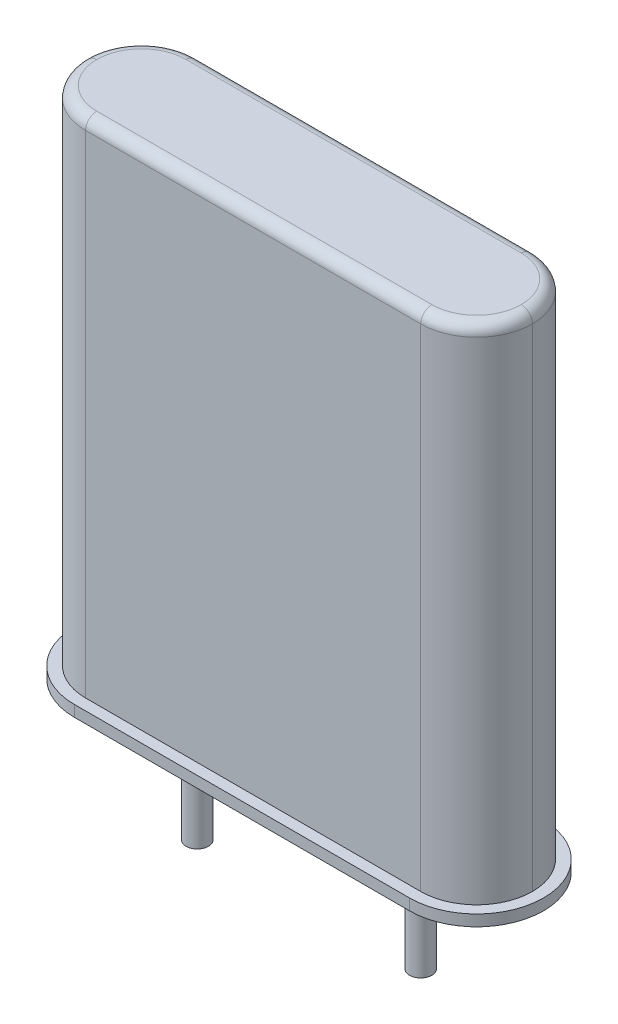
ISO-10303-21;
HEADER;
FILE_DESCRIPTION(('STEP AP214'),'2;1');
FILE_NAME('part.step','',(''),(''),'','','');
FILE_SCHEMA(('AUTOMOTIVE_DESIGN { 1 0 10303 214 1 1 1 1 }'));
ENDSEC;
DATA;
#1=APPLICATION_CONTEXT('core data for automotive mechanical design processes');
#2=APPLICATION_PROTOCOL_DEFINITION('international standard','automotive_design',2000,#1);
#3=PRODUCT_CONTEXT('',#1,'mechanical');
#4=PRODUCT('Part','Part','',(#3));
#5=PRODUCT_RELATED_PRODUCT_CATEGORY('part','',(#4));
#6=PRODUCT_DEFINITION_FORMATION('','',#4);
#7=PRODUCT_DEFINITION_CONTEXT('part definition',#1,'design');
#8=PRODUCT_DEFINITION('design','',#6,#7);
#9=PRODUCT_DEFINITION_SHAPE('','',#8);
#10=(LENGTH_UNIT() NAMED_UNIT(*) SI_UNIT(.MILLI.,.METRE.));
#11=(NAMED_UNIT(*) PLANE_ANGLE_UNIT() SI_UNIT($,.RADIAN.));
#12=(NAMED_UNIT(*) SI_UNIT($,.STERADIAN.) SOLID_ANGLE_UNIT());
#13=UNCERTAINTY_MEASURE_WITH_UNIT(LENGTH_MEASURE(1.E-05),#10,'distance_accuracy_value','');
#14=(GEOMETRIC_REPRESENTATION_CONTEXT(3) GLOBAL_UNCERTAINTY_ASSIGNED_CONTEXT((#13)) GLOBAL_UNIT_ASSIGNED_CONTEXT((#10,
#11,#12)) REPRESENTATION_CONTEXT('',''));
#15=CARTESIAN_POINT('',(0.,0.,0.));
#16=DIRECTION('',(0.,0.,1.));
#17=DIRECTION('',(1.,0.,0.));
#18=AXIS2_PLACEMENT_3D('',#15,#16,#17);
#19=CARTESIAN_POINT('',(-2.54,11.684,1.27));
#20=DIRECTION('',(0.,0.,-1.));
#21=DIRECTION('',(-1.,0.,0.));
#22=AXIS2_PLACEMENT_3D('',#19,#20,#21);
#23=PLANE('',#22);
#24=DIRECTION('',(-1.,0.,0.));
#25=VECTOR('',#24,1.);
#26=CARTESIAN_POINT('',(-2.54,0.254000000000001,1.27));
#27=LINE('',#26,#25);
#28=CARTESIAN_POINT('',(6.35,0.254000000000001,1.27));
#29=VERTEX_POINT('',#28);
#30=CARTESIAN_POINT('',(-1.27,0.254000000000001,1.27));
#31=VERTEX_POINT('',#30);
#32=EDGE_CURVE('E176',#29,#31,#27,.T.);
#33=ORIENTED_EDGE('',*,*,#32,.F.);
#34=DIRECTION('',(0.,1.,0.));
#35=VECTOR('',#34,1.);
#36=CARTESIAN_POINT('',(6.35,11.684,1.27));
#37=LINE('',#36,#35);
#38=CARTESIAN_POINT('',(6.35,11.43,1.27));
#39=VERTEX_POINT('',#38);
#40=EDGE_CURVE('E192',#29,#39,#37,.T.);
#41=ORIENTED_EDGE('',*,*,#40,.T.);
#42=DIRECTION('',(-1.,0.,0.));
#43=VECTOR('',#42,1.);
#44=CARTESIAN_POINT('',(-2.54,11.43,1.27));
#45=LINE('',#44,#43);
#46=CARTESIAN_POINT('',(-1.27,11.43,1.27));
#47=VERTEX_POINT('',#46);
#48=EDGE_CURVE('E228',#39,#47,#45,.T.);
#49=ORIENTED_EDGE('',*,*,#48,.T.);
#50=DIRECTION('',(0.,-1.,0.));
#51=VECTOR('',#50,1.);
#52=CARTESIAN_POINT('',(-1.27,11.684,1.27));
#53=LINE('',#52,#51);
#54=EDGE_CURVE('E194',#47,#31,#53,.T.);
#55=ORIENTED_EDGE('',*,*,#54,.T.);
#56=EDGE_LOOP('',(#33,#41,#49,#55));
#57=FACE_BOUND('',#56,.T.);
#58=ADVANCED_FACE('F31',(#57),#23,.F.);
#59=CARTESIAN_POINT('',(-2.54,11.684,-1.27));
#60=DIRECTION('',(0.,0.,-1.));
#61=DIRECTION('',(-1.,0.,0.));
#62=AXIS2_PLACEMENT_3D('',#59,#60,#61);
#63=PLANE('',#62);
#64=DIRECTION('',(0.,1.,0.));
#65=VECTOR('',#64,1.);
#66=CARTESIAN_POINT('',(6.35,0.,-1.27));
#67=LINE('',#66,#65);
#68=CARTESIAN_POINT('',(6.35,11.43,-1.27));
#69=VERTEX_POINT('',#68);
#70=CARTESIAN_POINT('',(6.35,0.254,-1.27));
#71=VERTEX_POINT('',#70);
#72=EDGE_CURVE('E197',#69,#71,#67,.F.);
#73=ORIENTED_EDGE('',*,*,#72,.T.);
#74=DIRECTION('',(-1.,0.,0.));
#75=VECTOR('',#74,1.);
#76=CARTESIAN_POINT('',(-2.54,0.254000000000001,-1.27));
#77=LINE('',#76,#75);
#78=CARTESIAN_POINT('',(-1.27,0.254000000000001,-1.27));
#79=VERTEX_POINT('',#78);
#80=EDGE_CURVE('E173',#71,#79,#77,.T.);
#81=ORIENTED_EDGE('',*,*,#80,.T.);
#82=DIRECTION('',(0.,-1.,0.));
#83=VECTOR('',#82,1.);
#84=CARTESIAN_POINT('',(-1.27,11.684,-1.27));
#85=LINE('',#84,#83);
#86=CARTESIAN_POINT('',(-1.27,11.43,-1.27));
#87=VERTEX_POINT('',#86);
#88=EDGE_CURVE('E200',#79,#87,#85,.F.);
#89=ORIENTED_EDGE('',*,*,#88,.T.);
#90=DIRECTION('',(-1.,0.,0.));
#91=VECTOR('',#90,1.);
#92=CARTESIAN_POINT('',(6.35,11.43,-1.27));
#93=LINE('',#92,#91);
#94=EDGE_CURVE('E219',#87,#69,#93,.F.);
#95=ORIENTED_EDGE('',*,*,#94,.T.);
#96=EDGE_LOOP('',(#73,#81,#89,#95));
#97=FACE_BOUND('',#96,.T.);
#98=ADVANCED_FACE('F267',(#97),#63,.T.);
#99=CARTESIAN_POINT('',(-1.27,0.,0.));
#100=DIRECTION('',(0.,1.,0.));
#101=DIRECTION('',(0.,0.,1.));
#102=AXIS2_PLACEMENT_3D('',#99,#100,#101);
#103=CYLINDRICAL_SURFACE('',#102,1.27);
#104=ORIENTED_EDGE('',*,*,#88,.F.);
#105=CARTESIAN_POINT('',(-1.27,0.254,0.));
#106=DIRECTION('',(0.,-1.,0.));
#107=DIRECTION('',(0.,0.,-1.));
#108=AXIS2_PLACEMENT_3D('',#105,#106,#107);
#109=CIRCLE('',#108,1.27);
#110=CARTESIAN_POINT('',(-2.54,0.254000000000001,0.));
#111=VERTEX_POINT('',#110);
#112=EDGE_CURVE('E181',#79,#111,#109,.F.);
#113=ORIENTED_EDGE('',*,*,#112,.T.);
#114=DIRECTION('',(0.,-1.,0.));
#115=VECTOR('',#114,1.);
#116=CARTESIAN_POINT('',(-2.54,0.,0.));
#117=LINE('',#116,#115);
#118=CARTESIAN_POINT('',(-2.54,11.43,0.));
#119=VERTEX_POINT('',#118);
#120=EDGE_CURVE('E189',#119,#111,#117,.T.);
#121=ORIENTED_EDGE('',*,*,#120,.F.);
#122=CARTESIAN_POINT('',(-1.27,11.43,0.));
#123=DIRECTION('',(0.,-1.,0.));
#124=DIRECTION('',(0.,0.,-1.));
#125=AXIS2_PLACEMENT_3D('',#122,#123,#124);
#126=CIRCLE('',#125,1.27);
#127=EDGE_CURVE('E40',#119,#87,#126,.T.);
#128=ORIENTED_EDGE('',*,*,#127,.T.);
#129=EDGE_LOOP('',(#104,#113,#121,#128));
#130=FACE_BOUND('',#129,.T.);
#131=ADVANCED_FACE('F262',(#130),#103,.T.);
#132=CARTESIAN_POINT('',(-1.27,11.684,0.));
#133=DIRECTION('',(0.,-1.,0.));
#134=DIRECTION('',(0.,0.,-1.));
#135=AXIS2_PLACEMENT_3D('',#132,#133,#134);
#136=CYLINDRICAL_SURFACE('',#135,1.27);
#137=ORIENTED_EDGE('',*,*,#120,.T.);
#138=CARTESIAN_POINT('',(-1.27,0.254000000000001,0.));
#139=DIRECTION('',(0.,-1.,0.));
#140=DIRECTION('',(0.,0.,-1.));
#141=AXIS2_PLACEMENT_3D('',#138,#139,#140);
#142=CIRCLE('',#141,1.27);
#143=EDGE_CURVE('E178',#111,#31,#142,.F.);
#144=ORIENTED_EDGE('',*,*,#143,.T.);
#145=ORIENTED_EDGE('',*,*,#54,.F.);
#146=CARTESIAN_POINT('',(-1.27,11.43,0.));
#147=DIRECTION('',(0.,-1.,0.));
#148=DIRECTION('',(0.,0.,-1.));
#149=AXIS2_PLACEMENT_3D('',#146,#147,#148);
#150=CIRCLE('',#149,1.27);
#151=EDGE_CURVE('E54',#47,#119,#150,.T.);
#152=ORIENTED_EDGE('',*,*,#151,.T.);
#153=EDGE_LOOP('',(#137,#144,#145,#152));
#154=FACE_BOUND('',#153,.T.);
#155=ADVANCED_FACE('F259',(#154),#136,.T.);
#156=CARTESIAN_POINT('',(6.35,0.,0.));
#157=DIRECTION('',(0.,-1.,0.));
#158=DIRECTION('',(0.,0.,-1.));
#159=AXIS2_PLACEMENT_3D('',#156,#157,#158);
#160=CYLINDRICAL_SURFACE('',#159,1.27);
#161=DIRECTION('',(0.,1.,0.));
#162=VECTOR('',#161,1.);
#163=CARTESIAN_POINT('',(7.62,11.684,0.));
#164=LINE('',#163,#162);
#165=CARTESIAN_POINT('',(7.62,0.254000000000001,0.));
#166=VERTEX_POINT('',#165);
#167=CARTESIAN_POINT('',(7.62,11.43,0.));
#168=VERTEX_POINT('',#167);
#169=EDGE_CURVE('E204',#166,#168,#164,.T.);
#170=ORIENTED_EDGE('',*,*,#169,.F.);
#171=CARTESIAN_POINT('',(6.35,0.254,0.));
#172=DIRECTION('',(0.,-1.,0.));
#173=DIRECTION('',(0.,0.,-1.));
#174=AXIS2_PLACEMENT_3D('',#171,#172,#173);
#175=CIRCLE('',#174,1.27);
#176=EDGE_CURVE('E47',#166,#71,#175,.F.);
#177=ORIENTED_EDGE('',*,*,#176,.T.);
#178=ORIENTED_EDGE('',*,*,#72,.F.);
#179=CARTESIAN_POINT('',(6.35,11.43,0.));
#180=DIRECTION('',(0.,-1.,0.));
#181=DIRECTION('',(0.,0.,-1.));
#182=AXIS2_PLACEMENT_3D('',#179,#180,#181);
#183=CIRCLE('',#182,1.27);
#184=EDGE_CURVE('E222',#69,#168,#183,.T.);
#185=ORIENTED_EDGE('',*,*,#184,.T.);
#186=EDGE_LOOP('',(#170,#177,#178,#185));
#187=FACE_BOUND('',#186,.T.);
#188=ADVANCED_FACE('F271',(#187),#160,.T.);
#189=CARTESIAN_POINT('',(6.35,11.684,0.));
#190=DIRECTION('',(0.,1.,0.));
#191=DIRECTION('',(0.,0.,1.));
#192=AXIS2_PLACEMENT_3D('',#189,#190,#191);
#193=CYLINDRICAL_SURFACE('',#192,1.27);
#194=ORIENTED_EDGE('',*,*,#40,.F.);
#195=CARTESIAN_POINT('',(6.35,0.254000000000001,0.));
#196=DIRECTION('',(0.,-1.,0.));
#197=DIRECTION('',(0.,0.,-1.));
#198=AXIS2_PLACEMENT_3D('',#195,#196,#197);
#199=CIRCLE('',#198,1.27);
#200=EDGE_CURVE('E11',#29,#166,#199,.F.);
#201=ORIENTED_EDGE('',*,*,#200,.T.);
#202=ORIENTED_EDGE('',*,*,#169,.T.);
#203=CARTESIAN_POINT('',(6.35,11.43,0.));
#204=DIRECTION('',(0.,-1.,0.));
#205=DIRECTION('',(0.,0.,-1.));
#206=AXIS2_PLACEMENT_3D('',#203,#204,#205);
#207=CIRCLE('',#206,1.27);
#208=EDGE_CURVE('E225',#168,#39,#207,.T.);
#209=ORIENTED_EDGE('',*,*,#208,.T.);
#210=EDGE_LOOP('',(#194,#201,#202,#209));
#211=FACE_BOUND('',#210,.T.);
#212=ADVANCED_FACE('F274',(#211),#193,.T.);
#213=CARTESIAN_POINT('',(-2.54,11.684,1.27));
#214=DIRECTION('',(0.,-1.,0.));
#215=DIRECTION('',(0.,0.,-1.));
#216=AXIS2_PLACEMENT_3D('',#213,#214,#215);
#217=PLANE('',#216);
#218=CARTESIAN_POINT('',(6.35,11.684,0.));
#219=DIRECTION('',(0.,-1.,0.));
#220=DIRECTION('',(0.,0.,-1.));
#221=AXIS2_PLACEMENT_3D('',#218,#219,#220);
#222=CIRCLE('',#221,1.016);
#223=CARTESIAN_POINT('',(7.366,11.684,0.));
#224=VERTEX_POINT('',#223);
#225=CARTESIAN_POINT('',(6.35,11.684,-1.016));
#226=VERTEX_POINT('',#225);
#227=EDGE_CURVE('E214',#224,#226,#222,.F.);
#228=ORIENTED_EDGE('',*,*,#227,.T.);
#229=DIRECTION('',(-1.,0.,0.));
#230=VECTOR('',#229,1.);
#231=CARTESIAN_POINT('',(-1.27,11.684,-1.016));
#232=LINE('',#231,#230);
#233=CARTESIAN_POINT('',(-1.27,11.684,-1.016));
#234=VERTEX_POINT('',#233);
#235=EDGE_CURVE('E216',#226,#234,#232,.T.);
#236=ORIENTED_EDGE('',*,*,#235,.T.);
#237=CARTESIAN_POINT('',(-1.27,11.684,0.));
#238=DIRECTION('',(0.,-1.,0.));
#239=DIRECTION('',(0.,0.,-1.));
#240=AXIS2_PLACEMENT_3D('',#237,#238,#239);
#241=CIRCLE('',#240,1.016);
#242=CARTESIAN_POINT('',(-2.286,11.684,0.));
#243=VERTEX_POINT('',#242);
#244=EDGE_CURVE('E202',#234,#243,#241,.F.);
#245=ORIENTED_EDGE('',*,*,#244,.T.);
#246=CARTESIAN_POINT('',(-1.27,11.684,0.));
#247=DIRECTION('',(0.,-1.,0.));
#248=DIRECTION('',(0.,0.,-1.));
#249=AXIS2_PLACEMENT_3D('',#246,#247,#248);
#250=CIRCLE('',#249,1.016);
#251=CARTESIAN_POINT('',(-1.27,11.684,1.016));
#252=VERTEX_POINT('',#251);
#253=EDGE_CURVE('E208',#243,#252,#250,.F.);
#254=ORIENTED_EDGE('',*,*,#253,.T.);
#255=DIRECTION('',(-1.,0.,0.));
#256=VECTOR('',#255,1.);
#257=CARTESIAN_POINT('',(-2.54,11.684,1.016));
#258=LINE('',#257,#256);
#259=CARTESIAN_POINT('',(6.35,11.684,1.016));
#260=VERTEX_POINT('',#259);
#261=EDGE_CURVE('E210',#252,#260,#258,.F.);
#262=ORIENTED_EDGE('',*,*,#261,.T.);
#263=CARTESIAN_POINT('',(6.35,11.684,0.));
#264=DIRECTION('',(0.,-1.,0.));
#265=DIRECTION('',(0.,0.,-1.));
#266=AXIS2_PLACEMENT_3D('',#263,#264,#265);
#267=CIRCLE('',#266,1.016);
#268=EDGE_CURVE('E212',#260,#224,#267,.F.);
#269=ORIENTED_EDGE('',*,*,#268,.T.);
#270=EDGE_LOOP('',(#228,#236,#245,#254,#262,#269));
#271=FACE_BOUND('',#270,.T.);
#272=ADVANCED_FACE('F276',(#271),#217,.F.);
#273=CARTESIAN_POINT('',(-2.54,11.43,1.016));
#274=DIRECTION('',(-1.,0.,0.));
#275=DIRECTION('',(0.,0.,1.));
#276=AXIS2_PLACEMENT_3D('',#273,#274,#275);
#277=CYLINDRICAL_SURFACE('',#276,0.254);
#278=CARTESIAN_POINT('',(-1.27,11.43,1.016));
#279=DIRECTION('',(-1.,0.,0.));
#280=DIRECTION('',(0.,0.,1.));
#281=AXIS2_PLACEMENT_3D('',#278,#279,#280);
#282=CIRCLE('',#281,0.254);
#283=EDGE_CURVE('E242',#47,#252,#282,.T.);
#284=ORIENTED_EDGE('',*,*,#283,.F.);
#285=ORIENTED_EDGE('',*,*,#48,.F.);
#286=CARTESIAN_POINT('',(6.35,11.43,1.016));
#287=DIRECTION('',(1.,0.,0.));
#288=DIRECTION('',(0.,0.,-1.));
#289=AXIS2_PLACEMENT_3D('',#286,#287,#288);
#290=CIRCLE('',#289,0.254);
#291=EDGE_CURVE('E206',#260,#39,#290,.T.);
#292=ORIENTED_EDGE('',*,*,#291,.F.);
#293=ORIENTED_EDGE('',*,*,#261,.F.);
#294=EDGE_LOOP('',(#284,#285,#292,#293));
#295=FACE_BOUND('',#294,.T.);
#296=ADVANCED_FACE('F33',(#295),#277,.T.);
#297=CARTESIAN_POINT('',(6.35,11.43,0.));
#298=DIRECTION('',(0.,-1.,0.));
#299=DIRECTION('',(0.,0.,-1.));
#300=AXIS2_PLACEMENT_3D('',#297,#298,#299);
#301=TOROIDAL_SURFACE('',#300,1.016,0.254);
#302=ORIENTED_EDGE('',*,*,#291,.T.);
#303=ORIENTED_EDGE('',*,*,#208,.F.);
#304=CARTESIAN_POINT('',(7.366,11.43,0.));
#305=DIRECTION('',(0.,0.,-1.));
#306=DIRECTION('',(-1.,0.,0.));
#307=AXIS2_PLACEMENT_3D('',#304,#305,#306);
#308=CIRCLE('',#307,0.254);
#309=EDGE_CURVE('E239',#224,#168,#308,.T.);
#310=ORIENTED_EDGE('',*,*,#309,.F.);
#311=ORIENTED_EDGE('',*,*,#268,.F.);
#312=EDGE_LOOP('',(#302,#303,#310,#311));
#313=FACE_BOUND('',#312,.T.);
#314=ADVANCED_FACE('F250',(#313),#301,.T.);
#315=CARTESIAN_POINT('',(-1.27,11.43,0.));
#316=DIRECTION('',(0.,-1.,0.));
#317=DIRECTION('',(0.,0.,-1.));
#318=AXIS2_PLACEMENT_3D('',#315,#316,#317);
#319=TOROIDAL_SURFACE('',#318,1.016,0.254);
#320=ORIENTED_EDGE('',*,*,#283,.T.);
#321=ORIENTED_EDGE('',*,*,#253,.F.);
#322=CARTESIAN_POINT('',(-2.286,11.43,0.));
#323=DIRECTION('',(0.,0.,-1.));
#324=DIRECTION('',(-1.,0.,0.));
#325=AXIS2_PLACEMENT_3D('',#322,#323,#324);
#326=CIRCLE('',#325,0.254);
#327=EDGE_CURVE('E236',#119,#243,#326,.T.);
#328=ORIENTED_EDGE('',*,*,#327,.F.);
#329=ORIENTED_EDGE('',*,*,#151,.F.);
#330=EDGE_LOOP('',(#320,#321,#328,#329));
#331=FACE_BOUND('',#330,.T.);
#332=ADVANCED_FACE('F445',(#331),#319,.T.);
#333=CARTESIAN_POINT('',(6.35,11.43,0.));
#334=DIRECTION('',(0.,-1.,0.));
#335=DIRECTION('',(0.,0.,-1.));
#336=AXIS2_PLACEMENT_3D('',#333,#334,#335);
#337=TOROIDAL_SURFACE('',#336,1.016,0.254);
#338=ORIENTED_EDGE('',*,*,#309,.T.);
#339=ORIENTED_EDGE('',*,*,#184,.F.);
#340=CARTESIAN_POINT('',(6.35,11.43,-1.016));
#341=DIRECTION('',(-1.,0.,0.));
#342=DIRECTION('',(0.,0.,1.));
#343=AXIS2_PLACEMENT_3D('',#340,#341,#342);
#344=CIRCLE('',#343,0.254);
#345=EDGE_CURVE('E234',#226,#69,#344,.T.);
#346=ORIENTED_EDGE('',*,*,#345,.F.);
#347=ORIENTED_EDGE('',*,*,#227,.F.);
#348=EDGE_LOOP('',(#338,#339,#346,#347));
#349=FACE_BOUND('',#348,.T.);
#350=ADVANCED_FACE('F452',(#349),#337,.T.);
#351=CARTESIAN_POINT('',(-1.27,11.43,0.));
#352=DIRECTION('',(0.,-1.,0.));
#353=DIRECTION('',(0.,0.,-1.));
#354=AXIS2_PLACEMENT_3D('',#351,#352,#353);
#355=TOROIDAL_SURFACE('',#354,1.016,0.254);
#356=ORIENTED_EDGE('',*,*,#327,.T.);
#357=ORIENTED_EDGE('',*,*,#244,.F.);
#358=CARTESIAN_POINT('',(-1.27,11.43,-1.016));
#359=DIRECTION('',(1.,0.,0.));
#360=DIRECTION('',(0.,0.,-1.));
#361=AXIS2_PLACEMENT_3D('',#358,#359,#360);
#362=CIRCLE('',#361,0.254);
#363=EDGE_CURVE('E184',#87,#234,#362,.T.);
#364=ORIENTED_EDGE('',*,*,#363,.F.);
#365=ORIENTED_EDGE('',*,*,#127,.F.);
#366=EDGE_LOOP('',(#356,#357,#364,#365));
#367=FACE_BOUND('',#366,.T.);
#368=ADVANCED_FACE('F461',(#367),#355,.T.);
#369=CARTESIAN_POINT('',(-2.54,11.43,-1.016));
#370=DIRECTION('',(1.,0.,0.));
#371=DIRECTION('',(0.,0.,-1.));
#372=AXIS2_PLACEMENT_3D('',#369,#370,#371);
#373=CYLINDRICAL_SURFACE('',#372,0.254);
#374=ORIENTED_EDGE('',*,*,#345,.T.);
#375=ORIENTED_EDGE('',*,*,#94,.F.);
#376=ORIENTED_EDGE('',*,*,#363,.T.);
#377=ORIENTED_EDGE('',*,*,#235,.F.);
#378=EDGE_LOOP('',(#374,#375,#376,#377));
#379=FACE_BOUND('',#378,.T.);
#380=ADVANCED_FACE('F337',(#379),#373,.T.);
#381=CARTESIAN_POINT('',(6.35,0.254,0.));
#382=DIRECTION('',(0.,-1.,0.));
#383=DIRECTION('',(0.,0.,-1.));
#384=AXIS2_PLACEMENT_3D('',#381,#382,#383);
#385=CYLINDRICAL_SURFACE('',#384,1.524);
#386=CARTESIAN_POINT('',(6.35,0.,0.));
#387=DIRECTION('',(0.,-1.,0.));
#388=DIRECTION('',(0.,0.,-1.));
#389=AXIS2_PLACEMENT_3D('',#386,#387,#388);
#390=CIRCLE('',#389,1.524);
#391=CARTESIAN_POINT('',(6.35,0.,-1.524));
#392=VERTEX_POINT('',#391);
#393=CARTESIAN_POINT('',(6.35,0.,1.524));
#394=VERTEX_POINT('',#393);
#395=EDGE_CURVE('E153',#392,#394,#390,.T.);
#396=ORIENTED_EDGE('',*,*,#395,.F.);
#397=DIRECTION('',(0.,-1.,0.));
#398=VECTOR('',#397,1.);
#399=CARTESIAN_POINT('',(6.35,0.254,-1.524));
#400=LINE('',#399,#398);
#401=CARTESIAN_POINT('',(6.35,0.254,-1.524));
#402=VERTEX_POINT('',#401);
#403=EDGE_CURVE('E151',#402,#392,#400,.T.);
#404=ORIENTED_EDGE('',*,*,#403,.F.);
#405=CARTESIAN_POINT('',(6.35,0.254,0.));
#406=DIRECTION('',(0.,-1.,0.));
#407=DIRECTION('',(0.,0.,-1.));
#408=AXIS2_PLACEMENT_3D('',#405,#406,#407);
#409=CIRCLE('',#408,1.524);
#410=CARTESIAN_POINT('',(6.35,0.254,1.524));
#411=VERTEX_POINT('',#410);
#412=EDGE_CURVE('E146',#402,#411,#409,.T.);
#413=ORIENTED_EDGE('',*,*,#412,.T.);
#414=DIRECTION('',(0.,-1.,0.));
#415=VECTOR('',#414,1.);
#416=CARTESIAN_POINT('',(6.35,0.254,1.524));
#417=LINE('',#416,#415);
#418=EDGE_CURVE('E129',#411,#394,#417,.T.);
#419=ORIENTED_EDGE('',*,*,#418,.T.);
#420=EDGE_LOOP('',(#396,#404,#413,#419));
#421=FACE_BOUND('',#420,.T.);
#422=ADVANCED_FACE('F150',(#421),#385,.T.);
#423=CARTESIAN_POINT('',(-1.27,0.254,-1.524));
#424=DIRECTION('',(0.,0.,-1.));
#425=DIRECTION('',(-1.,0.,0.));
#426=AXIS2_PLACEMENT_3D('',#423,#424,#425);
#427=PLANE('',#426);
#428=DIRECTION('',(1.,0.,0.));
#429=VECTOR('',#428,1.);
#430=CARTESIAN_POINT('',(-1.27,0.,-1.524));
#431=LINE('',#430,#429);
#432=CARTESIAN_POINT('',(-1.27,0.,-1.524));
#433=VERTEX_POINT('',#432);
#434=EDGE_CURVE('E155',#433,#392,#431,.T.);
#435=ORIENTED_EDGE('',*,*,#434,.F.);
#436=DIRECTION('',(0.,-1.,0.));
#437=VECTOR('',#436,1.);
#438=CARTESIAN_POINT('',(-1.27,0.254,-1.524));
#439=LINE('',#438,#437);
#440=CARTESIAN_POINT('',(-1.27,0.254,-1.524));
#441=VERTEX_POINT('',#440);
#442=EDGE_CURVE('E169',#441,#433,#439,.T.);
#443=ORIENTED_EDGE('',*,*,#442,.F.);
#444=DIRECTION('',(1.,0.,0.));
#445=VECTOR('',#444,1.);
#446=CARTESIAN_POINT('',(-1.27,0.254,-1.524));
#447=LINE('',#446,#445);
#448=EDGE_CURVE('E140',#441,#402,#447,.T.);
#449=ORIENTED_EDGE('',*,*,#448,.T.);
#450=ORIENTED_EDGE('',*,*,#403,.T.);
#451=EDGE_LOOP('',(#435,#443,#449,#450));
#452=FACE_BOUND('',#451,.T.);
#453=ADVANCED_FACE('F336',(#452),#427,.T.);
#454=CARTESIAN_POINT('',(-1.27,0.254,0.));
#455=DIRECTION('',(0.,-1.,0.));
#456=DIRECTION('',(0.,0.,-1.));
#457=AXIS2_PLACEMENT_3D('',#454,#455,#456);
#458=CYLINDRICAL_SURFACE('',#457,1.524);
#459=CARTESIAN_POINT('',(-1.27,0.,0.));
#460=DIRECTION('',(0.,-1.,0.));
#461=DIRECTION('',(0.,0.,-1.));
#462=AXIS2_PLACEMENT_3D('',#459,#460,#461);
#463=CIRCLE('',#462,1.524);
#464=CARTESIAN_POINT('',(-1.27,0.,1.524));
#465=VERTEX_POINT('',#464);
#466=EDGE_CURVE('E163',#465,#433,#463,.T.);
#467=ORIENTED_EDGE('',*,*,#466,.F.);
#468=DIRECTION('',(0.,-1.,0.));
#469=VECTOR('',#468,1.);
#470=CARTESIAN_POINT('',(-1.27,0.254,1.524));
#471=LINE('',#470,#469);
#472=CARTESIAN_POINT('',(-1.27,0.254,1.524));
#473=VERTEX_POINT('',#472);
#474=EDGE_CURVE('E139',#473,#465,#471,.T.);
#475=ORIENTED_EDGE('',*,*,#474,.F.);
#476=CARTESIAN_POINT('',(-1.27,0.254,0.));
#477=DIRECTION('',(0.,-1.,0.));
#478=DIRECTION('',(0.,0.,-1.));
#479=AXIS2_PLACEMENT_3D('',#476,#477,#478);
#480=CIRCLE('',#479,1.524);
#481=EDGE_CURVE('E148',#473,#441,#480,.T.);
#482=ORIENTED_EDGE('',*,*,#481,.T.);
#483=ORIENTED_EDGE('',*,*,#442,.T.);
#484=EDGE_LOOP('',(#467,#475,#482,#483));
#485=FACE_BOUND('',#484,.T.);
#486=ADVANCED_FACE('F348',(#485),#458,.T.);
#487=CARTESIAN_POINT('',(6.35,0.254,1.524));
#488=DIRECTION('',(0.,0.,1.));
#489=DIRECTION('',(1.,0.,0.));
#490=AXIS2_PLACEMENT_3D('',#487,#488,#489);
#491=PLANE('',#490);
#492=DIRECTION('',(-1.,0.,0.));
#493=VECTOR('',#492,1.);
#494=CARTESIAN_POINT('',(6.35,0.,1.524));
#495=LINE('',#494,#493);
#496=EDGE_CURVE('E135',#394,#465,#495,.T.);
#497=ORIENTED_EDGE('',*,*,#496,.F.);
#498=ORIENTED_EDGE('',*,*,#418,.F.);
#499=DIRECTION('',(-1.,0.,0.));
#500=VECTOR('',#499,1.);
#501=CARTESIAN_POINT('',(6.35,0.254,1.524));
#502=LINE('',#501,#500);
#503=EDGE_CURVE('E133',#411,#473,#502,.T.);
#504=ORIENTED_EDGE('',*,*,#503,.T.);
#505=ORIENTED_EDGE('',*,*,#474,.T.);
#506=EDGE_LOOP('',(#497,#498,#504,#505));
#507=FACE_BOUND('',#506,.T.);
#508=ADVANCED_FACE('F131',(#507),#491,.T.);
#509=CARTESIAN_POINT('',(6.35,0.254,0.));
#510=DIRECTION('',(0.,-1.,0.));
#511=DIRECTION('',(0.,0.,-1.));
#512=AXIS2_PLACEMENT_3D('',#509,#510,#511);
#513=PLANE('',#512);
#514=ORIENTED_EDGE('',*,*,#112,.F.);
#515=ORIENTED_EDGE('',*,*,#80,.F.);
#516=ORIENTED_EDGE('',*,*,#176,.F.);
#517=ORIENTED_EDGE('',*,*,#200,.F.);
#518=ORIENTED_EDGE('',*,*,#32,.T.);
#519=ORIENTED_EDGE('',*,*,#143,.F.);
#520=EDGE_LOOP('',(#514,#515,#516,#517,#518,#519));
#521=FACE_BOUND('',#520,.T.);
#522=ORIENTED_EDGE('',*,*,#412,.F.);
#523=ORIENTED_EDGE('',*,*,#448,.F.);
#524=ORIENTED_EDGE('',*,*,#481,.F.);
#525=ORIENTED_EDGE('',*,*,#503,.F.);
#526=EDGE_LOOP('',(#522,#523,#524,#525));
#527=FACE_BOUND('',#526,.T.);
#528=ADVANCED_FACE('F144',(#521,#527),#513,.F.);
#529=CARTESIAN_POINT('',(0.,-2.54,0.));
#530=DIRECTION('',(0.,-1.,0.));
#531=DIRECTION('',(0.,0.,-1.));
#532=AXIS2_PLACEMENT_3D('',#529,#530,#531);
#533=PLANE('',#532);
#534=CARTESIAN_POINT('',(0.,-2.54,0.));
#535=DIRECTION('',(0.,-1.,0.));
#536=DIRECTION('',(0.,0.,-1.));
#537=AXIS2_PLACEMENT_3D('',#534,#535,#536);
#538=CIRCLE('',#537,0.254);
#539=CARTESIAN_POINT('',(0.,-2.54,-0.254));
#540=VERTEX_POINT('',#539);
#541=EDGE_CURVE('E185',#540,#540,#538,.T.);
#542=ORIENTED_EDGE('',*,*,#541,.T.);
#543=EDGE_LOOP('',(#542));
#544=FACE_BOUND('',#543,.T.);
#545=ADVANCED_FACE('F301',(#544),#533,.T.);
#546=CARTESIAN_POINT('',(0.,-2.54,0.));
#547=DIRECTION('',(0.,1.,0.));
#548=DIRECTION('',(0.,0.,1.));
#549=AXIS2_PLACEMENT_3D('',#546,#547,#548);
#550=CYLINDRICAL_SURFACE('',#549,0.254);
#551=ORIENTED_EDGE('',*,*,#541,.F.);
#552=EDGE_LOOP('',(#551));
#553=FACE_BOUND('',#552,.T.);
#554=CARTESIAN_POINT('',(0.,0.,0.));
#555=DIRECTION('',(0.,1.,0.));
#556=DIRECTION('',(0.,0.,1.));
#557=AXIS2_PLACEMENT_3D('',#554,#555,#556);
#558=CIRCLE('',#557,0.254);
#559=CARTESIAN_POINT('',(0.,0.,0.254));
#560=VERTEX_POINT('',#559);
#561=EDGE_CURVE('E188',#560,#560,#558,.T.);
#562=ORIENTED_EDGE('',*,*,#561,.F.);
#563=EDGE_LOOP('',(#562));
#564=FACE_BOUND('',#563,.T.);
#565=ADVANCED_FACE('F299',(#553,#564),#550,.T.);
#566=CARTESIAN_POINT('',(-2.54,0.,1.27));
#567=DIRECTION('',(0.,1.,0.));
#568=DIRECTION('',(0.,0.,1.));
#569=AXIS2_PLACEMENT_3D('',#566,#567,#568);
#570=PLANE('',#569);
#571=CARTESIAN_POINT('',(5.08,0.,0.));
#572=DIRECTION('',(0.,1.,0.));
#573=DIRECTION('',(0.,0.,1.));
#574=AXIS2_PLACEMENT_3D('',#571,#572,#573);
#575=CIRCLE('',#574,0.254);
#576=CARTESIAN_POINT('',(5.08,0.,0.254));
#577=VERTEX_POINT('',#576);
#578=EDGE_CURVE('E35',#577,#577,#575,.T.);
#579=ORIENTED_EDGE('',*,*,#578,.T.);
#580=EDGE_LOOP('',(#579));
#581=FACE_BOUND('',#580,.T.);
#582=ORIENTED_EDGE('',*,*,#561,.T.);
#583=EDGE_LOOP('',(#582));
#584=FACE_BOUND('',#583,.T.);
#585=ORIENTED_EDGE('',*,*,#395,.T.);
#586=ORIENTED_EDGE('',*,*,#496,.T.);
#587=ORIENTED_EDGE('',*,*,#466,.T.);
#588=ORIENTED_EDGE('',*,*,#434,.T.);
#589=EDGE_LOOP('',(#585,#586,#587,#588));
#590=FACE_BOUND('',#589,.T.);
#591=ADVANCED_FACE('F295',(#581,#584,#590),#570,.F.);
#592=CARTESIAN_POINT('',(5.08,-2.54,0.));
#593=DIRECTION('',(0.,1.,0.));
#594=DIRECTION('',(0.,0.,1.));
#595=AXIS2_PLACEMENT_3D('',#592,#593,#594);
#596=CYLINDRICAL_SURFACE('',#595,0.254);
#597=CARTESIAN_POINT('',(5.08,-2.54,0.));
#598=DIRECTION('',(0.,1.,0.));
#599=DIRECTION('',(0.,0.,-1.));
#600=AXIS2_PLACEMENT_3D('',#597,#598,#599);
#601=CIRCLE('',#600,0.254);
#602=CARTESIAN_POINT('',(5.08,-2.54,-0.254));
#603=VERTEX_POINT('',#602);
#604=EDGE_CURVE('E158',#603,#603,#601,.T.);
#605=ORIENTED_EDGE('',*,*,#604,.T.);
#606=EDGE_LOOP('',(#605));
#607=FACE_BOUND('',#606,.T.);
#608=ORIENTED_EDGE('',*,*,#578,.F.);
#609=EDGE_LOOP('',(#608));
#610=FACE_BOUND('',#609,.T.);
#611=ADVANCED_FACE('F298',(#607,#610),#596,.T.);
#612=CARTESIAN_POINT('',(5.08,-2.54,0.));
#613=DIRECTION('',(0.,-1.,0.));
#614=DIRECTION('',(0.,0.,-1.));
#615=AXIS2_PLACEMENT_3D('',#612,#613,#614);
#616=PLANE('',#615);
#617=ORIENTED_EDGE('',*,*,#604,.F.);
#618=EDGE_LOOP('',(#617));
#619=FACE_BOUND('',#618,.T.);
#620=ADVANCED_FACE('F389',(#619),#616,.T.);
#621=CLOSED_SHELL('',(#58,#98,#131,#155,#188,#212,#272,#296,#314,#332,#350,#368,#380,#422,#453,
#486,#508,#528,#545,#565,#591,#611,#620));
#622=MANIFOLD_SOLID_BREP('B2',#621);
#623=ADVANCED_BREP_SHAPE_REPRESENTATION('',(#18,#622),#14);
#624=SHAPE_DEFINITION_REPRESENTATION(#9,#623);
ENDSEC;
END-ISO-10303-21;
